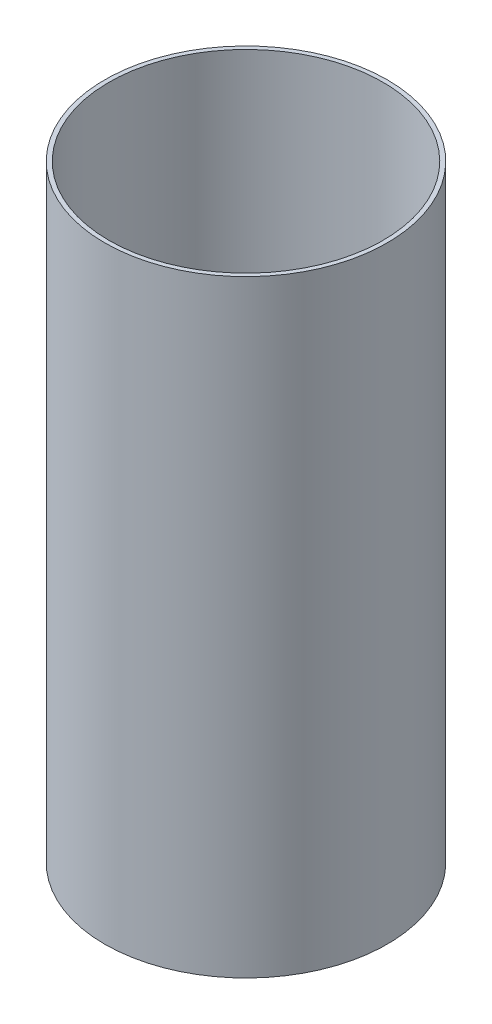
ISO-10303-21;
HEADER;
FILE_DESCRIPTION(('STEP AP214'),'2;1');
FILE_NAME('part.step','',(''),(''),'','','');
FILE_SCHEMA(('AUTOMOTIVE_DESIGN { 1 0 10303 214 1 1 1 1 }'));
ENDSEC;
DATA;
#1=APPLICATION_CONTEXT('core data for automotive mechanical design processes');
#2=APPLICATION_PROTOCOL_DEFINITION('international standard','automotive_design',2000,#1);
#3=PRODUCT_CONTEXT('',#1,'mechanical');
#4=PRODUCT('Part','Part','',(#3));
#5=PRODUCT_RELATED_PRODUCT_CATEGORY('part','',(#4));
#6=PRODUCT_DEFINITION_FORMATION('','',#4);
#7=PRODUCT_DEFINITION_CONTEXT('part definition',#1,'design');
#8=PRODUCT_DEFINITION('design','',#6,#7);
#9=PRODUCT_DEFINITION_SHAPE('','',#8);
#10=(LENGTH_UNIT() NAMED_UNIT(*) SI_UNIT(.MILLI.,.METRE.));
#11=(NAMED_UNIT(*) PLANE_ANGLE_UNIT() SI_UNIT($,.RADIAN.));
#12=(NAMED_UNIT(*) SI_UNIT($,.STERADIAN.) SOLID_ANGLE_UNIT());
#13=UNCERTAINTY_MEASURE_WITH_UNIT(LENGTH_MEASURE(1.E-05),#10,'distance_accuracy_value','');
#14=(GEOMETRIC_REPRESENTATION_CONTEXT(3) GLOBAL_UNCERTAINTY_ASSIGNED_CONTEXT((#13)) GLOBAL_UNIT_ASSIGNED_CONTEXT((#10,
#11,#12)) REPRESENTATION_CONTEXT('',''));
#15=CARTESIAN_POINT('',(0.,0.,0.));
#16=DIRECTION('',(0.,0.,1.));
#17=DIRECTION('',(1.,0.,0.));
#18=AXIS2_PLACEMENT_3D('',#15,#16,#17);
#19=CARTESIAN_POINT('',(0.,136.525,0.));
#20=DIRECTION('',(0.,1.,0.));
#21=DIRECTION('',(0.,0.,1.));
#22=AXIS2_PLACEMENT_3D('',#19,#20,#21);
#23=PLANE('',#22);
#24=CARTESIAN_POINT('',(0.,136.525,0.));
#25=DIRECTION('',(0.,1.,0.));
#26=DIRECTION('',(0.,0.,1.));
#27=AXIS2_PLACEMENT_3D('',#24,#25,#26);
#28=CIRCLE('',#27,63.5);
#29=CARTESIAN_POINT('',(0.,136.525,63.5));
#30=VERTEX_POINT('',#29);
#31=EDGE_CURVE('E10',#30,#30,#28,.T.);
#32=ORIENTED_EDGE('',*,*,#31,.T.);
#33=EDGE_LOOP('',(#32));
#34=FACE_BOUND('',#33,.T.);
#35=CARTESIAN_POINT('',(0.,136.525,0.));
#36=DIRECTION('',(0.,1.,0.));
#37=DIRECTION('',(0.,0.,1.));
#38=AXIS2_PLACEMENT_3D('',#35,#36,#37);
#39=CIRCLE('',#38,61.595);
#40=CARTESIAN_POINT('',(0.,136.525,61.595));
#41=VERTEX_POINT('',#40);
#42=EDGE_CURVE('E54',#41,#41,#39,.T.);
#43=ORIENTED_EDGE('',*,*,#42,.F.);
#44=EDGE_LOOP('',(#43));
#45=FACE_BOUND('',#44,.T.);
#46=ADVANCED_FACE('F41',(#34,#45),#23,.T.);
#47=CARTESIAN_POINT('',(0.,-136.525,0.));
#48=DIRECTION('',(0.,1.,0.));
#49=DIRECTION('',(0.,0.,1.));
#50=AXIS2_PLACEMENT_3D('',#47,#48,#49);
#51=PLANE('',#50);
#52=CARTESIAN_POINT('',(0.,-136.525,0.));
#53=DIRECTION('',(0.,1.,0.));
#54=DIRECTION('',(0.,0.,1.));
#55=AXIS2_PLACEMENT_3D('',#52,#53,#54);
#56=CIRCLE('',#55,63.5);
#57=CARTESIAN_POINT('',(0.,-136.525,63.5));
#58=VERTEX_POINT('',#57);
#59=EDGE_CURVE('E45',#58,#58,#56,.T.);
#60=ORIENTED_EDGE('',*,*,#59,.F.);
#61=EDGE_LOOP('',(#60));
#62=FACE_BOUND('',#61,.T.);
#63=CARTESIAN_POINT('',(0.,-136.525,0.));
#64=DIRECTION('',(0.,1.,0.));
#65=DIRECTION('',(0.,0.,1.));
#66=AXIS2_PLACEMENT_3D('',#63,#64,#65);
#67=CIRCLE('',#66,61.595);
#68=CARTESIAN_POINT('',(0.,-136.525,61.595));
#69=VERTEX_POINT('',#68);
#70=EDGE_CURVE('E56',#69,#69,#67,.T.);
#71=ORIENTED_EDGE('',*,*,#70,.T.);
#72=EDGE_LOOP('',(#71));
#73=FACE_BOUND('',#72,.T.);
#74=ADVANCED_FACE('F68',(#62,#73),#51,.F.);
#75=CARTESIAN_POINT('',(0.,136.525,0.));
#76=DIRECTION('',(0.,-1.,0.));
#77=DIRECTION('',(0.,0.,-1.));
#78=AXIS2_PLACEMENT_3D('',#75,#76,#77);
#79=CYLINDRICAL_SURFACE('',#78,63.5);
#80=ORIENTED_EDGE('',*,*,#31,.F.);
#81=EDGE_LOOP('',(#80));
#82=FACE_BOUND('',#81,.T.);
#83=ORIENTED_EDGE('',*,*,#59,.T.);
#84=EDGE_LOOP('',(#83));
#85=FACE_BOUND('',#84,.T.);
#86=ADVANCED_FACE('F43',(#82,#85),#79,.T.);
#87=CARTESIAN_POINT('',(0.,136.525,0.));
#88=DIRECTION('',(0.,-1.,0.));
#89=DIRECTION('',(0.,0.,-1.));
#90=AXIS2_PLACEMENT_3D('',#87,#88,#89);
#91=CYLINDRICAL_SURFACE('',#90,61.595);
#92=ORIENTED_EDGE('',*,*,#42,.T.);
#93=EDGE_LOOP('',(#92));
#94=FACE_BOUND('',#93,.T.);
#95=ORIENTED_EDGE('',*,*,#70,.F.);
#96=EDGE_LOOP('',(#95));
#97=FACE_BOUND('',#96,.T.);
#98=ADVANCED_FACE('F64',(#94,#97),#91,.F.);
#99=CLOSED_SHELL('',(#46,#74,#86,#98));
#100=MANIFOLD_SOLID_BREP('B2',#99);
#101=ADVANCED_BREP_SHAPE_REPRESENTATION('',(#18,#100),#14);
#102=SHAPE_DEFINITION_REPRESENTATION(#9,#101);
ENDSEC;
END-ISO-10303-21;
